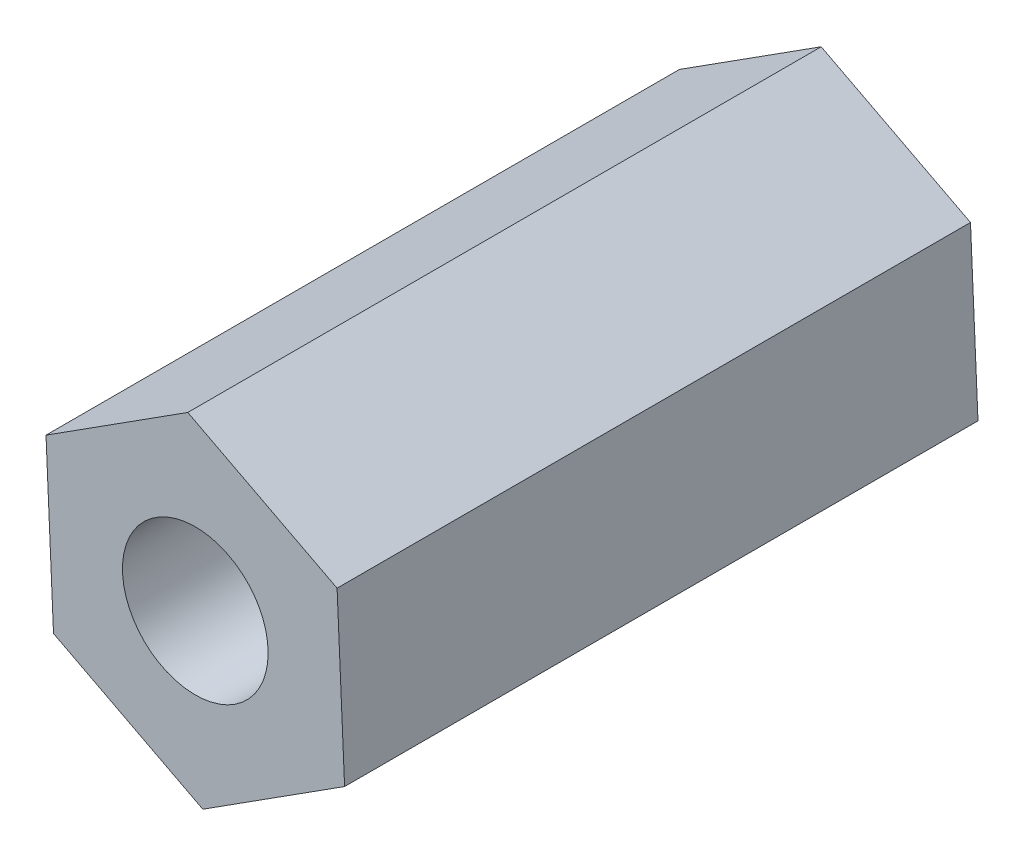
ISO-10303-21;
HEADER;
FILE_DESCRIPTION(('STEP AP214'),'2;1');
FILE_NAME('part.step','',(''),(''),'','','');
FILE_SCHEMA(('AUTOMOTIVE_DESIGN { 1 0 10303 214 1 1 1 1 }'));
ENDSEC;
DATA;
#1=APPLICATION_CONTEXT('core data for automotive mechanical design processes');
#2=APPLICATION_PROTOCOL_DEFINITION('international standard','automotive_design',2000,#1);
#3=PRODUCT_CONTEXT('',#1,'mechanical');
#4=PRODUCT('Part','Part','',(#3));
#5=PRODUCT_RELATED_PRODUCT_CATEGORY('part','',(#4));
#6=PRODUCT_DEFINITION_FORMATION('','',#4);
#7=PRODUCT_DEFINITION_CONTEXT('part definition',#1,'design');
#8=PRODUCT_DEFINITION('design','',#6,#7);
#9=PRODUCT_DEFINITION_SHAPE('','',#8);
#10=(LENGTH_UNIT() NAMED_UNIT(*) SI_UNIT(.MILLI.,.METRE.));
#11=(NAMED_UNIT(*) PLANE_ANGLE_UNIT() SI_UNIT($,.RADIAN.));
#12=(NAMED_UNIT(*) SI_UNIT($,.STERADIAN.) SOLID_ANGLE_UNIT());
#13=UNCERTAINTY_MEASURE_WITH_UNIT(LENGTH_MEASURE(1.E-05),#10,'distance_accuracy_value','');
#14=(GEOMETRIC_REPRESENTATION_CONTEXT(3) GLOBAL_UNCERTAINTY_ASSIGNED_CONTEXT((#13)) GLOBAL_UNIT_ASSIGNED_CONTEXT((#10,
#11,#12)) REPRESENTATION_CONTEXT('',''));
#15=CARTESIAN_POINT('',(0.,0.,0.));
#16=DIRECTION('',(0.,0.,1.));
#17=DIRECTION('',(1.,0.,0.));
#18=AXIS2_PLACEMENT_3D('',#15,#16,#17);
#19=CARTESIAN_POINT('',(0.,0.,10.));
#20=DIRECTION('',(0.,0.,1.));
#21=DIRECTION('',(1.,0.,0.));
#22=AXIS2_PLACEMENT_3D('',#19,#20,#21);
#23=PLANE('',#22);
#24=DIRECTION('',(0.842825769233019,0.53818651294581,0.));
#25=VECTOR('',#24,1.);
#26=CARTESIAN_POINT('',(0.118635904858095,-2.65316016391999,10.));
#27=LINE('',#26,#25);
#28=CARTESIAN_POINT('',(0.118635904858095,-2.65316016391999,10.));
#29=VERTEX_POINT('',#28);
#30=CARTESIAN_POINT('',(2.35702205469264,-1.22383837455193,10.));
#31=VERTEX_POINT('',#30);
#32=EDGE_CURVE('E129',#29,#31,#27,.T.);
#33=ORIENTED_EDGE('',*,*,#32,.T.);
#34=DIRECTION('',(-0.0446703075687252,0.99900178359286,0.));
#35=VECTOR('',#34,1.);
#36=CARTESIAN_POINT('',(2.35702205469264,-1.22383837455193,10.));
#37=LINE('',#36,#35);
#38=CARTESIAN_POINT('',(2.23838614983454,1.42932178936806,10.));
#39=VERTEX_POINT('',#38);
#40=EDGE_CURVE('E87',#31,#39,#37,.T.);
#41=ORIENTED_EDGE('',*,*,#40,.T.);
#42=DIRECTION('',(-0.887496076801744,0.46081527064705,0.));
#43=VECTOR('',#42,1.);
#44=CARTESIAN_POINT('',(2.23838614983454,1.42932178936806,10.));
#45=LINE('',#44,#43);
#46=CARTESIAN_POINT('',(-0.118635904858095,2.65316016391998,10.));
#47=VERTEX_POINT('',#46);
#48=EDGE_CURVE('E100',#39,#47,#45,.T.);
#49=ORIENTED_EDGE('',*,*,#48,.T.);
#50=DIRECTION('',(-0.842825769233019,-0.53818651294581,0.));
#51=VECTOR('',#50,1.);
#52=CARTESIAN_POINT('',(-0.118635904858095,2.65316016391998,10.));
#53=LINE('',#52,#51);
#54=CARTESIAN_POINT('',(-2.35702205469264,1.22383837455192,10.));
#55=VERTEX_POINT('',#54);
#56=EDGE_CURVE('E94',#47,#55,#53,.T.);
#57=ORIENTED_EDGE('',*,*,#56,.T.);
#58=DIRECTION('',(0.0446703075687252,-0.99900178359286,0.));
#59=VECTOR('',#58,1.);
#60=CARTESIAN_POINT('',(-2.35702205469264,1.22383837455192,10.));
#61=LINE('',#60,#59);
#62=CARTESIAN_POINT('',(-2.23838614983454,-1.42932178936807,10.));
#63=VERTEX_POINT('',#62);
#64=EDGE_CURVE('E98',#55,#63,#61,.T.);
#65=ORIENTED_EDGE('',*,*,#64,.T.);
#66=DIRECTION('',(0.887496076801743,-0.46081527064705,0.));
#67=VECTOR('',#66,1.);
#68=CARTESIAN_POINT('',(-2.23838614983454,-1.42932178936807,10.));
#69=LINE('',#68,#67);
#70=EDGE_CURVE('E50',#63,#29,#69,.T.);
#71=ORIENTED_EDGE('',*,*,#70,.T.);
#72=EDGE_LOOP('',(#33,#41,#49,#57,#65,#71));
#73=FACE_BOUND('',#72,.T.);
#74=CARTESIAN_POINT('',(0.,0.,10.));
#75=DIRECTION('',(0.,0.,1.));
#76=DIRECTION('',(1.,0.,0.));
#77=AXIS2_PLACEMENT_3D('',#74,#75,#76);
#78=CIRCLE('',#77,1.15);
#79=CARTESIAN_POINT('',(1.15,0.,10.));
#80=VERTEX_POINT('',#79);
#81=EDGE_CURVE('E122',#80,#80,#78,.T.);
#82=ORIENTED_EDGE('',*,*,#81,.F.);
#83=EDGE_LOOP('',(#82));
#84=FACE_BOUND('',#83,.T.);
#85=ADVANCED_FACE('F33',(#73,#84),#23,.T.);
#86=CARTESIAN_POINT('',(0.,0.,0.));
#87=DIRECTION('',(0.,0.,1.));
#88=DIRECTION('',(1.,0.,0.));
#89=AXIS2_PLACEMENT_3D('',#86,#87,#88);
#90=PLANE('',#89);
#91=DIRECTION('',(0.842825769233019,0.53818651294581,0.));
#92=VECTOR('',#91,1.);
#93=CARTESIAN_POINT('',(0.118635904858095,-2.65316016391999,0.));
#94=LINE('',#93,#92);
#95=CARTESIAN_POINT('',(0.118635904858095,-2.65316016391999,0.));
#96=VERTEX_POINT('',#95);
#97=CARTESIAN_POINT('',(2.35702205469264,-1.22383837455193,0.));
#98=VERTEX_POINT('',#97);
#99=EDGE_CURVE('E118',#96,#98,#94,.T.);
#100=ORIENTED_EDGE('',*,*,#99,.F.);
#101=DIRECTION('',(0.887496076801743,-0.46081527064705,0.));
#102=VECTOR('',#101,1.);
#103=CARTESIAN_POINT('',(-2.23838614983454,-1.42932178936807,0.));
#104=LINE('',#103,#102);
#105=CARTESIAN_POINT('',(-2.23838614983454,-1.42932178936807,0.));
#106=VERTEX_POINT('',#105);
#107=EDGE_CURVE('E79',#106,#96,#104,.T.);
#108=ORIENTED_EDGE('',*,*,#107,.F.);
#109=DIRECTION('',(0.0446703075687252,-0.99900178359286,0.));
#110=VECTOR('',#109,1.);
#111=CARTESIAN_POINT('',(-2.35702205469264,1.22383837455192,0.));
#112=LINE('',#111,#110);
#113=CARTESIAN_POINT('',(-2.35702205469264,1.22383837455192,0.));
#114=VERTEX_POINT('',#113);
#115=EDGE_CURVE('E73',#114,#106,#112,.T.);
#116=ORIENTED_EDGE('',*,*,#115,.F.);
#117=DIRECTION('',(-0.842825769233019,-0.53818651294581,0.));
#118=VECTOR('',#117,1.);
#119=CARTESIAN_POINT('',(-0.118635904858095,2.65316016391998,0.));
#120=LINE('',#119,#118);
#121=CARTESIAN_POINT('',(-0.118635904858095,2.65316016391998,0.));
#122=VERTEX_POINT('',#121);
#123=EDGE_CURVE('E108',#122,#114,#120,.T.);
#124=ORIENTED_EDGE('',*,*,#123,.F.);
#125=DIRECTION('',(-0.887496076801744,0.46081527064705,0.));
#126=VECTOR('',#125,1.);
#127=CARTESIAN_POINT('',(2.23838614983454,1.42932178936806,0.));
#128=LINE('',#127,#126);
#129=CARTESIAN_POINT('',(2.23838614983454,1.42932178936806,0.));
#130=VERTEX_POINT('',#129);
#131=EDGE_CURVE('E124',#130,#122,#128,.T.);
#132=ORIENTED_EDGE('',*,*,#131,.F.);
#133=DIRECTION('',(-0.0446703075687252,0.99900178359286,0.));
#134=VECTOR('',#133,1.);
#135=CARTESIAN_POINT('',(2.35702205469264,-1.22383837455193,0.));
#136=LINE('',#135,#134);
#137=EDGE_CURVE('E121',#98,#130,#136,.T.);
#138=ORIENTED_EDGE('',*,*,#137,.F.);
#139=EDGE_LOOP('',(#100,#108,#116,#124,#132,#138));
#140=FACE_BOUND('',#139,.T.);
#141=CARTESIAN_POINT('',(0.,0.,0.));
#142=DIRECTION('',(0.,0.,1.));
#143=DIRECTION('',(1.,0.,0.));
#144=AXIS2_PLACEMENT_3D('',#141,#142,#143);
#145=CIRCLE('',#144,1.15);
#146=CARTESIAN_POINT('',(1.15,0.,0.));
#147=VERTEX_POINT('',#146);
#148=EDGE_CURVE('E222',#147,#147,#145,.T.);
#149=ORIENTED_EDGE('',*,*,#148,.T.);
#150=EDGE_LOOP('',(#149));
#151=FACE_BOUND('',#150,.T.);
#152=ADVANCED_FACE('F138',(#140,#151),#90,.F.);
#153=CARTESIAN_POINT('',(0.118635904858095,-2.65316016391999,10.));
#154=DIRECTION('',(-0.53818651294581,0.842825769233019,0.));
#155=DIRECTION('',(-0.842825769233019,-0.53818651294581,0.));
#156=AXIS2_PLACEMENT_3D('',#153,#154,#155);
#157=PLANE('',#156);
#158=ORIENTED_EDGE('',*,*,#99,.T.);
#159=DIRECTION('',(0.,0.,-1.));
#160=VECTOR('',#159,1.);
#161=CARTESIAN_POINT('',(2.35702205469264,-1.22383837455193,10.));
#162=LINE('',#161,#160);
#163=EDGE_CURVE('E11',#31,#98,#162,.T.);
#164=ORIENTED_EDGE('',*,*,#163,.F.);
#165=ORIENTED_EDGE('',*,*,#32,.F.);
#166=DIRECTION('',(0.,0.,-1.));
#167=VECTOR('',#166,1.);
#168=CARTESIAN_POINT('',(0.118635904858095,-2.65316016391999,10.));
#169=LINE('',#168,#167);
#170=EDGE_CURVE('E114',#29,#96,#169,.T.);
#171=ORIENTED_EDGE('',*,*,#170,.T.);
#172=EDGE_LOOP('',(#158,#164,#165,#171));
#173=FACE_BOUND('',#172,.T.);
#174=ADVANCED_FACE('F35',(#173),#157,.F.);
#175=CARTESIAN_POINT('',(2.35702205469264,-1.22383837455193,10.));
#176=DIRECTION('',(-0.99900178359286,-0.0446703075687252,0.));
#177=DIRECTION('',(0.0446703075687252,-0.99900178359286,0.));
#178=AXIS2_PLACEMENT_3D('',#175,#176,#177);
#179=PLANE('',#178);
#180=ORIENTED_EDGE('',*,*,#137,.T.);
#181=DIRECTION('',(0.,0.,-1.));
#182=VECTOR('',#181,1.);
#183=CARTESIAN_POINT('',(2.23838614983454,1.42932178936806,10.));
#184=LINE('',#183,#182);
#185=EDGE_CURVE('E42',#39,#130,#184,.T.);
#186=ORIENTED_EDGE('',*,*,#185,.F.);
#187=ORIENTED_EDGE('',*,*,#40,.F.);
#188=ORIENTED_EDGE('',*,*,#163,.T.);
#189=EDGE_LOOP('',(#180,#186,#187,#188));
#190=FACE_BOUND('',#189,.T.);
#191=ADVANCED_FACE('F163',(#190),#179,.F.);
#192=CARTESIAN_POINT('',(2.23838614983454,1.42932178936806,10.));
#193=DIRECTION('',(-0.46081527064705,-0.887496076801744,0.));
#194=DIRECTION('',(0.887496076801744,-0.46081527064705,0.));
#195=AXIS2_PLACEMENT_3D('',#192,#193,#194);
#196=PLANE('',#195);
#197=ORIENTED_EDGE('',*,*,#131,.T.);
#198=DIRECTION('',(0.,0.,-1.));
#199=VECTOR('',#198,1.);
#200=CARTESIAN_POINT('',(-0.118635904858095,2.65316016391998,10.));
#201=LINE('',#200,#199);
#202=EDGE_CURVE('E109',#47,#122,#201,.T.);
#203=ORIENTED_EDGE('',*,*,#202,.F.);
#204=ORIENTED_EDGE('',*,*,#48,.F.);
#205=ORIENTED_EDGE('',*,*,#185,.T.);
#206=EDGE_LOOP('',(#197,#203,#204,#205));
#207=FACE_BOUND('',#206,.T.);
#208=ADVANCED_FACE('F135',(#207),#196,.F.);
#209=CARTESIAN_POINT('',(-0.118635904858095,2.65316016391998,10.));
#210=DIRECTION('',(0.53818651294581,-0.842825769233019,0.));
#211=DIRECTION('',(0.842825769233019,0.53818651294581,0.));
#212=AXIS2_PLACEMENT_3D('',#209,#210,#211);
#213=PLANE('',#212);
#214=ORIENTED_EDGE('',*,*,#123,.T.);
#215=DIRECTION('',(0.,0.,-1.));
#216=VECTOR('',#215,1.);
#217=CARTESIAN_POINT('',(-2.35702205469264,1.22383837455192,10.));
#218=LINE('',#217,#216);
#219=EDGE_CURVE('E105',#55,#114,#218,.T.);
#220=ORIENTED_EDGE('',*,*,#219,.F.);
#221=ORIENTED_EDGE('',*,*,#56,.F.);
#222=ORIENTED_EDGE('',*,*,#202,.T.);
#223=EDGE_LOOP('',(#214,#220,#221,#222));
#224=FACE_BOUND('',#223,.T.);
#225=ADVANCED_FACE('F106',(#224),#213,.F.);
#226=CARTESIAN_POINT('',(-2.35702205469264,1.22383837455192,10.));
#227=DIRECTION('',(0.99900178359286,0.0446703075687252,0.));
#228=DIRECTION('',(-0.0446703075687252,0.99900178359286,0.));
#229=AXIS2_PLACEMENT_3D('',#226,#227,#228);
#230=PLANE('',#229);
#231=ORIENTED_EDGE('',*,*,#115,.T.);
#232=DIRECTION('',(0.,0.,-1.));
#233=VECTOR('',#232,1.);
#234=CARTESIAN_POINT('',(-2.23838614983454,-1.42932178936807,10.));
#235=LINE('',#234,#233);
#236=EDGE_CURVE('E110',#63,#106,#235,.T.);
#237=ORIENTED_EDGE('',*,*,#236,.F.);
#238=ORIENTED_EDGE('',*,*,#64,.F.);
#239=ORIENTED_EDGE('',*,*,#219,.T.);
#240=EDGE_LOOP('',(#231,#237,#238,#239));
#241=FACE_BOUND('',#240,.T.);
#242=ADVANCED_FACE('F112',(#241),#230,.F.);
#243=CARTESIAN_POINT('',(-2.23838614983454,-1.42932178936807,10.));
#244=DIRECTION('',(0.46081527064705,0.887496076801744,0.));
#245=DIRECTION('',(-0.887496076801744,0.46081527064705,0.));
#246=AXIS2_PLACEMENT_3D('',#243,#244,#245);
#247=PLANE('',#246);
#248=ORIENTED_EDGE('',*,*,#107,.T.);
#249=ORIENTED_EDGE('',*,*,#170,.F.);
#250=ORIENTED_EDGE('',*,*,#70,.F.);
#251=ORIENTED_EDGE('',*,*,#236,.T.);
#252=EDGE_LOOP('',(#248,#249,#250,#251));
#253=FACE_BOUND('',#252,.T.);
#254=ADVANCED_FACE('F143',(#253),#247,.F.);
#255=CARTESIAN_POINT('',(0.,0.,10.));
#256=DIRECTION('',(0.,0.,-1.));
#257=DIRECTION('',(-1.,0.,0.));
#258=AXIS2_PLACEMENT_3D('',#255,#256,#257);
#259=CYLINDRICAL_SURFACE('',#258,1.15);
#260=ORIENTED_EDGE('',*,*,#81,.T.);
#261=EDGE_LOOP('',(#260));
#262=FACE_BOUND('',#261,.T.);
#263=ORIENTED_EDGE('',*,*,#148,.F.);
#264=EDGE_LOOP('',(#263));
#265=FACE_BOUND('',#264,.T.);
#266=ADVANCED_FACE('F145',(#262,#265),#259,.F.);
#267=CLOSED_SHELL('',(#85,#152,#174,#191,#208,#225,#242,#254,#266));
#268=MANIFOLD_SOLID_BREP('B2',#267);
#269=ADVANCED_BREP_SHAPE_REPRESENTATION('',(#18,#268),#14);
#270=SHAPE_DEFINITION_REPRESENTATION(#9,#269);
ENDSEC;
END-ISO-10303-21;
